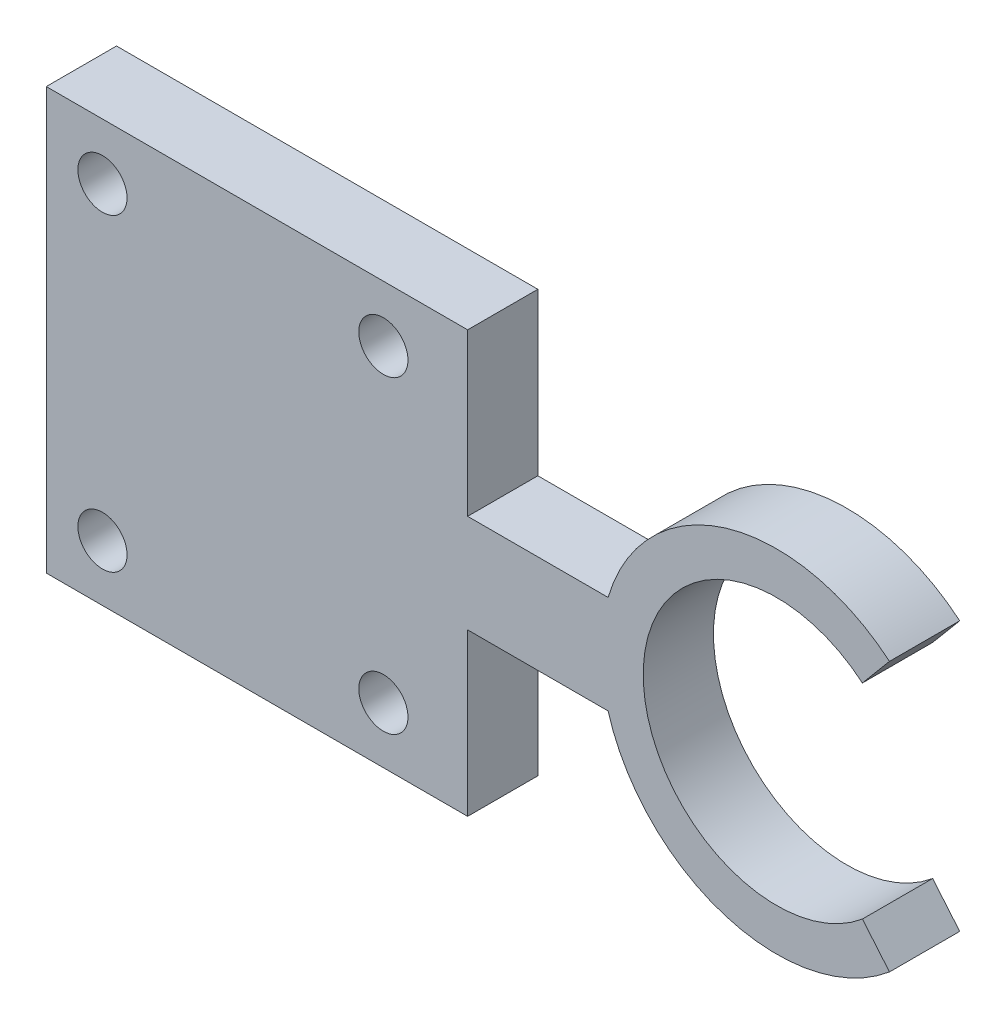
ISO-10303-21;
HEADER;
FILE_DESCRIPTION(('STEP AP214'),'2;1');
FILE_NAME('part.step','',(''),(''),'','','');
FILE_SCHEMA(('AUTOMOTIVE_DESIGN { 1 0 10303 214 1 1 1 1 }'));
ENDSEC;
DATA;
#1=APPLICATION_CONTEXT('core data for automotive mechanical design processes');
#2=APPLICATION_PROTOCOL_DEFINITION('international standard','automotive_design',2000,#1);
#3=PRODUCT_CONTEXT('',#1,'mechanical');
#4=PRODUCT('Part','Part','',(#3));
#5=PRODUCT_RELATED_PRODUCT_CATEGORY('part','',(#4));
#6=PRODUCT_DEFINITION_FORMATION('','',#4);
#7=PRODUCT_DEFINITION_CONTEXT('part definition',#1,'design');
#8=PRODUCT_DEFINITION('design','',#6,#7);
#9=PRODUCT_DEFINITION_SHAPE('','',#8);
#10=(LENGTH_UNIT() NAMED_UNIT(*) SI_UNIT(.MILLI.,.METRE.));
#11=(NAMED_UNIT(*) PLANE_ANGLE_UNIT() SI_UNIT($,.RADIAN.));
#12=(NAMED_UNIT(*) SI_UNIT($,.STERADIAN.) SOLID_ANGLE_UNIT());
#13=UNCERTAINTY_MEASURE_WITH_UNIT(LENGTH_MEASURE(1.E-05),#10,'distance_accuracy_value','');
#14=(GEOMETRIC_REPRESENTATION_CONTEXT(3) GLOBAL_UNCERTAINTY_ASSIGNED_CONTEXT((#13)) GLOBAL_UNIT_ASSIGNED_CONTEXT((#10,
#11,#12)) REPRESENTATION_CONTEXT('',''));
#15=CARTESIAN_POINT('',(0.,0.,0.));
#16=DIRECTION('',(0.,0.,1.));
#17=DIRECTION('',(1.,0.,0.));
#18=AXIS2_PLACEMENT_3D('',#15,#16,#17);
#19=CARTESIAN_POINT('',(-12.,3.5,-2.5));
#20=DIRECTION('',(0.,0.,1.));
#21=DIRECTION('',(1.,0.,0.));
#22=AXIS2_PLACEMENT_3D('',#19,#20,#21);
#23=PLANE('',#22);
#24=DIRECTION('',(-1.,0.,0.));
#25=VECTOR('',#24,1.);
#26=CARTESIAN_POINT('',(-12.,-3.5,-2.5));
#27=LINE('',#26,#25);
#28=CARTESIAN_POINT('',(-12.,-3.5,-2.5));
#29=VERTEX_POINT('',#28);
#30=CARTESIAN_POINT('',(-22.,-3.5,-2.5));
#31=VERTEX_POINT('',#30);
#32=EDGE_CURVE('E212',#29,#31,#27,.T.);
#33=ORIENTED_EDGE('',*,*,#32,.T.);
#34=DIRECTION('',(0.,-1.,0.));
#35=VECTOR('',#34,1.);
#36=CARTESIAN_POINT('',(-22.,15.,-2.5));
#37=LINE('',#36,#35);
#38=CARTESIAN_POINT('',(-22.,-15.,-2.5));
#39=VERTEX_POINT('',#38);
#40=EDGE_CURVE('E156',#31,#39,#37,.T.);
#41=ORIENTED_EDGE('',*,*,#40,.T.);
#42=DIRECTION('',(-1.,0.,0.));
#43=VECTOR('',#42,1.);
#44=CARTESIAN_POINT('',(-22.,-15.,-2.5));
#45=LINE('',#44,#43);
#46=CARTESIAN_POINT('',(-52.,-15.,-2.5));
#47=VERTEX_POINT('',#46);
#48=EDGE_CURVE('E253',#39,#47,#45,.T.);
#49=ORIENTED_EDGE('',*,*,#48,.T.);
#50=DIRECTION('',(0.,-1.,0.));
#51=VECTOR('',#50,1.);
#52=CARTESIAN_POINT('',(-52.,3.5,-2.5));
#53=LINE('',#52,#51);
#54=CARTESIAN_POINT('',(-52.,15.,-2.5));
#55=VERTEX_POINT('',#54);
#56=EDGE_CURVE('E40',#55,#47,#53,.T.);
#57=ORIENTED_EDGE('',*,*,#56,.F.);
#58=DIRECTION('',(1.,0.,0.));
#59=VECTOR('',#58,1.);
#60=CARTESIAN_POINT('',(-22.,15.,-2.5));
#61=LINE('',#60,#59);
#62=CARTESIAN_POINT('',(-22.,15.,-2.5));
#63=VERTEX_POINT('',#62);
#64=EDGE_CURVE('E251',#55,#63,#61,.T.);
#65=ORIENTED_EDGE('',*,*,#64,.T.);
#66=CARTESIAN_POINT('',(-22.,3.5,-2.5));
#67=VERTEX_POINT('',#66);
#68=EDGE_CURVE('E247',#63,#67,#37,.T.);
#69=ORIENTED_EDGE('',*,*,#68,.T.);
#70=DIRECTION('',(-1.,0.,0.));
#71=VECTOR('',#70,1.);
#72=CARTESIAN_POINT('',(-12.,3.5,-2.5));
#73=LINE('',#72,#71);
#74=CARTESIAN_POINT('',(-12.,3.5,-2.5));
#75=VERTEX_POINT('',#74);
#76=EDGE_CURVE('E52',#75,#67,#73,.T.);
#77=ORIENTED_EDGE('',*,*,#76,.F.);
#78=CARTESIAN_POINT('',(0.,0.,-2.5));
#79=DIRECTION('',(0.,0.,1.));
#80=DIRECTION('',(0.642787609686539,0.766044443118978,0.));
#81=AXIS2_PLACEMENT_3D('',#78,#79,#80);
#82=CIRCLE('',#81,12.5);
#83=CARTESIAN_POINT('',(8.03484512108174,9.57555553898723,-2.5));
#84=VERTEX_POINT('',#83);
#85=EDGE_CURVE('E176',#84,#75,#82,.T.);
#86=ORIENTED_EDGE('',*,*,#85,.F.);
#87=DIRECTION('',(0.642787609686539,0.766044443118979,0.));
#88=VECTOR('',#87,1.);
#89=CARTESIAN_POINT('',(6.10648229202213,7.27742220963029,-2.5));
#90=LINE('',#89,#88);
#91=CARTESIAN_POINT('',(6.10648229202213,7.27742220963029,-2.5));
#92=VERTEX_POINT('',#91);
#93=EDGE_CURVE('E194',#92,#84,#90,.T.);
#94=ORIENTED_EDGE('',*,*,#93,.F.);
#95=CARTESIAN_POINT('',(0.,0.,-2.5));
#96=DIRECTION('',(0.,0.,1.));
#97=DIRECTION('',(0.642787609686539,0.766044443118978,0.));
#98=AXIS2_PLACEMENT_3D('',#95,#96,#97);
#99=CIRCLE('',#98,9.5);
#100=CARTESIAN_POINT('',(6.10648229202215,-7.27742220963027,-2.5));
#101=VERTEX_POINT('',#100);
#102=EDGE_CURVE('E196',#92,#101,#99,.T.);
#103=ORIENTED_EDGE('',*,*,#102,.T.);
#104=DIRECTION('',(0.642787609686543,-0.766044443118975,0.));
#105=VECTOR('',#104,1.);
#106=CARTESIAN_POINT('',(6.10648229202215,-7.27742220963027,-2.5));
#107=LINE('',#106,#105);
#108=CARTESIAN_POINT('',(8.03484512108177,-9.5755555389872,-2.5));
#109=VERTEX_POINT('',#108);
#110=EDGE_CURVE('E199',#101,#109,#107,.T.);
#111=ORIENTED_EDGE('',*,*,#110,.T.);
#112=EDGE_CURVE('E183',#29,#109,#82,.T.);
#113=ORIENTED_EDGE('',*,*,#112,.F.);
#114=EDGE_LOOP('',(#33,#41,#49,#57,#65,#69,#77,#86,#94,#103,#111,#113));
#115=FACE_BOUND('',#114,.T.);
#116=CARTESIAN_POINT('',(-47.9999999999998,-11.,-2.5));
#117=DIRECTION('',(0.,0.,1.));
#118=DIRECTION('',(1.,0.,0.));
#119=AXIS2_PLACEMENT_3D('',#116,#117,#118);
#120=CIRCLE('',#119,1.75);
#121=CARTESIAN_POINT('',(-46.2499999999998,-11.,-2.5));
#122=VERTEX_POINT('',#121);
#123=EDGE_CURVE('E161',#122,#122,#120,.F.);
#124=ORIENTED_EDGE('',*,*,#123,.F.);
#125=EDGE_LOOP('',(#124));
#126=FACE_BOUND('',#125,.T.);
#127=CARTESIAN_POINT('',(-27.9999999999998,-11.,-2.5));
#128=DIRECTION('',(0.,0.,1.));
#129=DIRECTION('',(1.,0.,0.));
#130=AXIS2_PLACEMENT_3D('',#127,#128,#129);
#131=CIRCLE('',#130,1.75);
#132=CARTESIAN_POINT('',(-26.2499999999998,-11.,-2.5));
#133=VERTEX_POINT('',#132);
#134=EDGE_CURVE('E164',#133,#133,#131,.F.);
#135=ORIENTED_EDGE('',*,*,#134,.F.);
#136=EDGE_LOOP('',(#135));
#137=FACE_BOUND('',#136,.T.);
#138=CARTESIAN_POINT('',(-48.,11.,-2.5));
#139=DIRECTION('',(0.,0.,1.));
#140=DIRECTION('',(1.,0.,0.));
#141=AXIS2_PLACEMENT_3D('',#138,#139,#140);
#142=CIRCLE('',#141,1.75);
#143=CARTESIAN_POINT('',(-46.25,11.,-2.5));
#144=VERTEX_POINT('',#143);
#145=EDGE_CURVE('E168',#144,#144,#142,.F.);
#146=ORIENTED_EDGE('',*,*,#145,.F.);
#147=EDGE_LOOP('',(#146));
#148=FACE_BOUND('',#147,.T.);
#149=CARTESIAN_POINT('',(-28.,11.,-2.5));
#150=DIRECTION('',(0.,0.,1.));
#151=DIRECTION('',(1.,0.,0.));
#152=AXIS2_PLACEMENT_3D('',#149,#150,#151);
#153=CIRCLE('',#152,1.75);
#154=CARTESIAN_POINT('',(-26.25,11.,-2.5));
#155=VERTEX_POINT('',#154);
#156=EDGE_CURVE('E165',#155,#155,#153,.F.);
#157=ORIENTED_EDGE('',*,*,#156,.F.);
#158=EDGE_LOOP('',(#157));
#159=FACE_BOUND('',#158,.T.);
#160=ADVANCED_FACE('F33',(#115,#126,#137,#148,#159),#23,.F.);
#161=CARTESIAN_POINT('',(-52.,3.5,2.49999999999999));
#162=DIRECTION('',(1.,0.,0.));
#163=DIRECTION('',(0.,0.,-1.));
#164=AXIS2_PLACEMENT_3D('',#161,#162,#163);
#165=PLANE('',#164);
#166=ORIENTED_EDGE('',*,*,#56,.T.);
#167=DIRECTION('',(0.,0.,1.));
#168=VECTOR('',#167,1.);
#169=CARTESIAN_POINT('',(-52.,-15.,-44.9264068711928));
#170=LINE('',#169,#168);
#171=CARTESIAN_POINT('',(-52.,-15.,2.5));
#172=VERTEX_POINT('',#171);
#173=EDGE_CURVE('E133',#47,#172,#170,.T.);
#174=ORIENTED_EDGE('',*,*,#173,.T.);
#175=DIRECTION('',(0.,-1.,0.));
#176=VECTOR('',#175,1.);
#177=CARTESIAN_POINT('',(-52.,3.5,2.49999999999999));
#178=LINE('',#177,#176);
#179=CARTESIAN_POINT('',(-52.,15.,2.5));
#180=VERTEX_POINT('',#179);
#181=EDGE_CURVE('E118',#180,#172,#178,.T.);
#182=ORIENTED_EDGE('',*,*,#181,.F.);
#183=DIRECTION('',(0.,0.,1.));
#184=VECTOR('',#183,1.);
#185=CARTESIAN_POINT('',(-52.,15.,-44.9264068711928));
#186=LINE('',#185,#184);
#187=EDGE_CURVE('E154',#55,#180,#186,.T.);
#188=ORIENTED_EDGE('',*,*,#187,.F.);
#189=EDGE_LOOP('',(#166,#174,#182,#188));
#190=FACE_BOUND('',#189,.T.);
#191=ADVANCED_FACE('F134',(#190),#165,.F.);
#192=CARTESIAN_POINT('',(-12.,3.5,2.5));
#193=DIRECTION('',(0.,0.,-1.));
#194=DIRECTION('',(-1.,0.,0.));
#195=AXIS2_PLACEMENT_3D('',#192,#193,#194);
#196=PLANE('',#195);
#197=DIRECTION('',(1.,0.,0.));
#198=VECTOR('',#197,1.);
#199=CARTESIAN_POINT('',(-12.,3.5,2.5));
#200=LINE('',#199,#198);
#201=CARTESIAN_POINT('',(-22.,3.5,2.5));
#202=VERTEX_POINT('',#201);
#203=CARTESIAN_POINT('',(-12.,3.5,2.5));
#204=VERTEX_POINT('',#203);
#205=EDGE_CURVE('E130',#202,#204,#200,.T.);
#206=ORIENTED_EDGE('',*,*,#205,.F.);
#207=DIRECTION('',(0.,1.,0.));
#208=VECTOR('',#207,1.);
#209=CARTESIAN_POINT('',(-22.,15.,2.5));
#210=LINE('',#209,#208);
#211=CARTESIAN_POINT('',(-22.,15.,2.5));
#212=VERTEX_POINT('',#211);
#213=EDGE_CURVE('E143',#202,#212,#210,.T.);
#214=ORIENTED_EDGE('',*,*,#213,.T.);
#215=DIRECTION('',(-1.,0.,0.));
#216=VECTOR('',#215,1.);
#217=CARTESIAN_POINT('',(-22.,15.,2.5));
#218=LINE('',#217,#216);
#219=EDGE_CURVE('E126',#212,#180,#218,.T.);
#220=ORIENTED_EDGE('',*,*,#219,.T.);
#221=ORIENTED_EDGE('',*,*,#181,.T.);
#222=DIRECTION('',(1.,0.,0.));
#223=VECTOR('',#222,1.);
#224=CARTESIAN_POINT('',(-22.,-15.,2.5));
#225=LINE('',#224,#223);
#226=CARTESIAN_POINT('',(-22.,-15.,2.5));
#227=VERTEX_POINT('',#226);
#228=EDGE_CURVE('E124',#172,#227,#225,.T.);
#229=ORIENTED_EDGE('',*,*,#228,.T.);
#230=CARTESIAN_POINT('',(-22.,-3.5,2.5));
#231=VERTEX_POINT('',#230);
#232=EDGE_CURVE('E146',#227,#231,#210,.T.);
#233=ORIENTED_EDGE('',*,*,#232,.T.);
#234=DIRECTION('',(1.,0.,0.));
#235=VECTOR('',#234,1.);
#236=CARTESIAN_POINT('',(-12.,-3.5,2.5));
#237=LINE('',#236,#235);
#238=CARTESIAN_POINT('',(-12.,-3.5,2.5));
#239=VERTEX_POINT('',#238);
#240=EDGE_CURVE('E207',#231,#239,#237,.T.);
#241=ORIENTED_EDGE('',*,*,#240,.T.);
#242=CARTESIAN_POINT('',(0.,0.,2.5));
#243=DIRECTION('',(0.,0.,1.));
#244=DIRECTION('',(0.642787609686541,0.766044443118977,0.));
#245=AXIS2_PLACEMENT_3D('',#242,#243,#244);
#246=CIRCLE('',#245,12.5);
#247=CARTESIAN_POINT('',(8.03484512108176,-9.57555553898721,2.5));
#248=VERTEX_POINT('',#247);
#249=EDGE_CURVE('E175',#239,#248,#246,.T.);
#250=ORIENTED_EDGE('',*,*,#249,.T.);
#251=DIRECTION('',(-0.642787609686541,0.766044443118977,0.));
#252=VECTOR('',#251,1.);
#253=CARTESIAN_POINT('',(8.03484512108176,-9.57555553898721,2.5));
#254=LINE('',#253,#252);
#255=CARTESIAN_POINT('',(6.10648229202213,-7.27742220963028,2.5));
#256=VERTEX_POINT('',#255);
#257=EDGE_CURVE('E180',#248,#256,#254,.T.);
#258=ORIENTED_EDGE('',*,*,#257,.T.);
#259=CARTESIAN_POINT('',(0.,0.,2.5));
#260=DIRECTION('',(0.,0.,1.));
#261=DIRECTION('',(0.642787609686541,0.766044443118977,0.));
#262=AXIS2_PLACEMENT_3D('',#259,#260,#261);
#263=CIRCLE('',#262,9.5);
#264=CARTESIAN_POINT('',(6.10648229202214,7.27742220963028,2.5));
#265=VERTEX_POINT('',#264);
#266=EDGE_CURVE('E188',#265,#256,#263,.T.);
#267=ORIENTED_EDGE('',*,*,#266,.F.);
#268=DIRECTION('',(-0.642787609686541,-0.766044443118977,0.));
#269=VECTOR('',#268,1.);
#270=CARTESIAN_POINT('',(8.03484512108176,9.57555553898721,2.5));
#271=LINE('',#270,#269);
#272=CARTESIAN_POINT('',(8.03484512108176,9.57555553898721,2.5));
#273=VERTEX_POINT('',#272);
#274=EDGE_CURVE('E171',#273,#265,#271,.T.);
#275=ORIENTED_EDGE('',*,*,#274,.F.);
#276=EDGE_CURVE('E177',#273,#204,#246,.T.);
#277=ORIENTED_EDGE('',*,*,#276,.T.);
#278=EDGE_LOOP('',(#206,#214,#220,#221,#229,#233,#241,#250,#258,#267,#275,#277));
#279=FACE_BOUND('',#278,.T.);
#280=CARTESIAN_POINT('',(-47.9999999999998,-11.,2.5));
#281=DIRECTION('',(0.,0.,1.));
#282=DIRECTION('',(1.,0.,0.));
#283=AXIS2_PLACEMENT_3D('',#280,#281,#282);
#284=CIRCLE('',#283,1.75);
#285=CARTESIAN_POINT('',(-46.2499999999998,-11.,2.5));
#286=VERTEX_POINT('',#285);
#287=EDGE_CURVE('E258',#286,#286,#284,.T.);
#288=ORIENTED_EDGE('',*,*,#287,.F.);
#289=EDGE_LOOP('',(#288));
#290=FACE_BOUND('',#289,.T.);
#291=CARTESIAN_POINT('',(-27.9999999999998,-11.,2.5));
#292=DIRECTION('',(0.,0.,1.));
#293=DIRECTION('',(1.,0.,0.));
#294=AXIS2_PLACEMENT_3D('',#291,#292,#293);
#295=CIRCLE('',#294,1.75);
#296=CARTESIAN_POINT('',(-26.2499999999998,-11.,2.5));
#297=VERTEX_POINT('',#296);
#298=EDGE_CURVE('E261',#297,#297,#295,.T.);
#299=ORIENTED_EDGE('',*,*,#298,.F.);
#300=EDGE_LOOP('',(#299));
#301=FACE_BOUND('',#300,.T.);
#302=CARTESIAN_POINT('',(-48.,11.,2.5));
#303=DIRECTION('',(0.,0.,1.));
#304=DIRECTION('',(1.,0.,0.));
#305=AXIS2_PLACEMENT_3D('',#302,#303,#304);
#306=CIRCLE('',#305,1.75);
#307=CARTESIAN_POINT('',(-46.25,11.,2.5));
#308=VERTEX_POINT('',#307);
#309=EDGE_CURVE('E144',#308,#308,#306,.T.);
#310=ORIENTED_EDGE('',*,*,#309,.F.);
#311=EDGE_LOOP('',(#310));
#312=FACE_BOUND('',#311,.T.);
#313=CARTESIAN_POINT('',(-28.,11.,2.5));
#314=DIRECTION('',(0.,0.,1.));
#315=DIRECTION('',(1.,0.,0.));
#316=AXIS2_PLACEMENT_3D('',#313,#314,#315);
#317=CIRCLE('',#316,1.75);
#318=CARTESIAN_POINT('',(-26.25,11.,2.5));
#319=VERTEX_POINT('',#318);
#320=EDGE_CURVE('E149',#319,#319,#317,.T.);
#321=ORIENTED_EDGE('',*,*,#320,.F.);
#322=EDGE_LOOP('',(#321));
#323=FACE_BOUND('',#322,.T.);
#324=ADVANCED_FACE('F120',(#279,#290,#301,#312,#323),#196,.F.);
#325=CARTESIAN_POINT('',(0.,3.5,0.));
#326=DIRECTION('',(0.,-1.,0.));
#327=DIRECTION('',(0.,0.,-1.));
#328=AXIS2_PLACEMENT_3D('',#325,#326,#327);
#329=PLANE('',#328);
#330=ORIENTED_EDGE('',*,*,#76,.T.);
#331=DIRECTION('',(0.,0.,1.));
#332=VECTOR('',#331,1.);
#333=CARTESIAN_POINT('',(-22.,3.5,0.));
#334=LINE('',#333,#332);
#335=EDGE_CURVE('E47',#67,#202,#334,.T.);
#336=ORIENTED_EDGE('',*,*,#335,.T.);
#337=ORIENTED_EDGE('',*,*,#205,.T.);
#338=DIRECTION('',(0.,0.,-1.));
#339=VECTOR('',#338,1.);
#340=CARTESIAN_POINT('',(-12.,3.5,-2.5));
#341=LINE('',#340,#339);
#342=EDGE_CURVE('E205',#204,#75,#341,.T.);
#343=ORIENTED_EDGE('',*,*,#342,.T.);
#344=EDGE_LOOP('',(#330,#336,#337,#343));
#345=FACE_BOUND('',#344,.T.);
#346=ADVANCED_FACE('F269',(#345),#329,.F.);
#347=CARTESIAN_POINT('',(0.,-3.5,0.));
#348=DIRECTION('',(0.,-1.,0.));
#349=DIRECTION('',(0.,0.,-1.));
#350=AXIS2_PLACEMENT_3D('',#347,#348,#349);
#351=PLANE('',#350);
#352=DIRECTION('',(0.,0.,1.));
#353=VECTOR('',#352,1.);
#354=CARTESIAN_POINT('',(-22.,-3.5,0.));
#355=LINE('',#354,#353);
#356=EDGE_CURVE('E11',#31,#231,#355,.T.);
#357=ORIENTED_EDGE('',*,*,#356,.F.);
#358=ORIENTED_EDGE('',*,*,#32,.F.);
#359=DIRECTION('',(0.,0.,-1.));
#360=VECTOR('',#359,1.);
#361=CARTESIAN_POINT('',(-12.,-3.5,-2.5));
#362=LINE('',#361,#360);
#363=EDGE_CURVE('E204',#239,#29,#362,.T.);
#364=ORIENTED_EDGE('',*,*,#363,.F.);
#365=ORIENTED_EDGE('',*,*,#240,.F.);
#366=EDGE_LOOP('',(#357,#358,#364,#365));
#367=FACE_BOUND('',#366,.T.);
#368=ADVANCED_FACE('F220',(#367),#351,.T.);
#369=CARTESIAN_POINT('',(0.,0.,0.));
#370=DIRECTION('',(0.,0.,1.));
#371=DIRECTION('',(1.,0.,0.));
#372=AXIS2_PLACEMENT_3D('',#369,#370,#371);
#373=CYLINDRICAL_SURFACE('',#372,12.5);
#374=ORIENTED_EDGE('',*,*,#85,.T.);
#375=ORIENTED_EDGE('',*,*,#342,.F.);
#376=ORIENTED_EDGE('',*,*,#276,.F.);
#377=DIRECTION('',(0.,0.,1.));
#378=VECTOR('',#377,1.);
#379=CARTESIAN_POINT('',(8.03484512108174,9.57555553898723,-2.5));
#380=LINE('',#379,#378);
#381=EDGE_CURVE('E167',#84,#273,#380,.T.);
#382=ORIENTED_EDGE('',*,*,#381,.F.);
#383=EDGE_LOOP('',(#374,#375,#376,#382));
#384=FACE_BOUND('',#383,.T.);
#385=ADVANCED_FACE('F240',(#384),#373,.T.);
#386=CARTESIAN_POINT('',(0.,0.,0.));
#387=DIRECTION('',(0.766044443118977,-0.64278760968654,0.));
#388=DIRECTION('',(0.642787609686541,0.766044443118977,0.));
#389=AXIS2_PLACEMENT_3D('',#386,#387,#388);
#390=PLANE('',#389);
#391=ORIENTED_EDGE('',*,*,#381,.T.);
#392=ORIENTED_EDGE('',*,*,#274,.T.);
#393=DIRECTION('',(0.,0.,-1.));
#394=VECTOR('',#393,1.);
#395=CARTESIAN_POINT('',(6.10648229202214,7.27742220963028,2.5));
#396=LINE('',#395,#394);
#397=EDGE_CURVE('E186',#265,#92,#396,.T.);
#398=ORIENTED_EDGE('',*,*,#397,.T.);
#399=ORIENTED_EDGE('',*,*,#93,.T.);
#400=EDGE_LOOP('',(#391,#392,#398,#399));
#401=FACE_BOUND('',#400,.T.);
#402=ADVANCED_FACE('F235',(#401),#390,.T.);
#403=CARTESIAN_POINT('',(0.,0.,0.));
#404=DIRECTION('',(-0.766044443118977,-0.642787609686541,0.));
#405=DIRECTION('',(0.642787609686541,-0.766044443118977,0.));
#406=AXIS2_PLACEMENT_3D('',#403,#404,#405);
#407=PLANE('',#406);
#408=DIRECTION('',(0.,0.,1.));
#409=VECTOR('',#408,1.);
#410=CARTESIAN_POINT('',(8.03484512108177,-9.5755555389872,-2.5));
#411=LINE('',#410,#409);
#412=EDGE_CURVE('E172',#109,#248,#411,.T.);
#413=ORIENTED_EDGE('',*,*,#412,.F.);
#414=ORIENTED_EDGE('',*,*,#110,.F.);
#415=DIRECTION('',(0.,0.,-1.));
#416=VECTOR('',#415,1.);
#417=CARTESIAN_POINT('',(6.10648229202213,-7.27742220963028,2.5));
#418=LINE('',#417,#416);
#419=EDGE_CURVE('E191',#256,#101,#418,.T.);
#420=ORIENTED_EDGE('',*,*,#419,.F.);
#421=ORIENTED_EDGE('',*,*,#257,.F.);
#422=EDGE_LOOP('',(#413,#414,#420,#421));
#423=FACE_BOUND('',#422,.T.);
#424=ADVANCED_FACE('F229',(#423),#407,.F.);
#425=ORIENTED_EDGE('',*,*,#363,.T.);
#426=ORIENTED_EDGE('',*,*,#112,.T.);
#427=ORIENTED_EDGE('',*,*,#412,.T.);
#428=ORIENTED_EDGE('',*,*,#249,.F.);
#429=EDGE_LOOP('',(#425,#426,#427,#428));
#430=FACE_BOUND('',#429,.T.);
#431=ADVANCED_FACE('F223',(#430),#373,.T.);
#432=CARTESIAN_POINT('',(0.,0.,0.));
#433=DIRECTION('',(0.,0.,1.));
#434=DIRECTION('',(1.,0.,0.));
#435=AXIS2_PLACEMENT_3D('',#432,#433,#434);
#436=CYLINDRICAL_SURFACE('',#435,9.5);
#437=ORIENTED_EDGE('',*,*,#102,.F.);
#438=ORIENTED_EDGE('',*,*,#397,.F.);
#439=ORIENTED_EDGE('',*,*,#266,.T.);
#440=ORIENTED_EDGE('',*,*,#419,.T.);
#441=EDGE_LOOP('',(#437,#438,#439,#440));
#442=FACE_BOUND('',#441,.T.);
#443=ADVANCED_FACE('F233',(#442),#436,.F.);
#444=CARTESIAN_POINT('',(-27.9999999999998,-11.,-44.9264068711928));
#445=DIRECTION('',(0.,0.,1.));
#446=DIRECTION('',(1.,0.,0.));
#447=AXIS2_PLACEMENT_3D('',#444,#445,#446);
#448=CYLINDRICAL_SURFACE('',#447,1.75);
#449=ORIENTED_EDGE('',*,*,#134,.T.);
#450=EDGE_LOOP('',(#449));
#451=FACE_BOUND('',#450,.T.);
#452=ORIENTED_EDGE('',*,*,#298,.T.);
#453=EDGE_LOOP('',(#452));
#454=FACE_BOUND('',#453,.T.);
#455=ADVANCED_FACE('F297',(#451,#454),#448,.F.);
#456=CARTESIAN_POINT('',(-47.9999999999998,-11.,-44.9264068711928));
#457=DIRECTION('',(0.,0.,1.));
#458=DIRECTION('',(1.,0.,0.));
#459=AXIS2_PLACEMENT_3D('',#456,#457,#458);
#460=CYLINDRICAL_SURFACE('',#459,1.75);
#461=ORIENTED_EDGE('',*,*,#123,.T.);
#462=EDGE_LOOP('',(#461));
#463=FACE_BOUND('',#462,.T.);
#464=ORIENTED_EDGE('',*,*,#287,.T.);
#465=EDGE_LOOP('',(#464));
#466=FACE_BOUND('',#465,.T.);
#467=ADVANCED_FACE('F300',(#463,#466),#460,.F.);
#468=CARTESIAN_POINT('',(-22.,-15.,-44.9264068711928));
#469=DIRECTION('',(0.,-1.,0.));
#470=DIRECTION('',(1.,0.,0.));
#471=AXIS2_PLACEMENT_3D('',#468,#469,#470);
#472=PLANE('',#471);
#473=ORIENTED_EDGE('',*,*,#48,.F.);
#474=DIRECTION('',(0.,0.,1.));
#475=VECTOR('',#474,1.);
#476=CARTESIAN_POINT('',(-22.,-15.,-44.9264068711928));
#477=LINE('',#476,#475);
#478=EDGE_CURVE('E138',#39,#227,#477,.T.);
#479=ORIENTED_EDGE('',*,*,#478,.T.);
#480=ORIENTED_EDGE('',*,*,#228,.F.);
#481=ORIENTED_EDGE('',*,*,#173,.F.);
#482=EDGE_LOOP('',(#473,#479,#480,#481));
#483=FACE_BOUND('',#482,.T.);
#484=ADVANCED_FACE('F140',(#483),#472,.T.);
#485=CARTESIAN_POINT('',(-22.,15.,-44.9264068711928));
#486=DIRECTION('',(1.,0.,0.));
#487=DIRECTION('',(0.,1.,0.));
#488=AXIS2_PLACEMENT_3D('',#485,#486,#487);
#489=PLANE('',#488);
#490=ORIENTED_EDGE('',*,*,#40,.F.);
#491=ORIENTED_EDGE('',*,*,#356,.T.);
#492=ORIENTED_EDGE('',*,*,#232,.F.);
#493=ORIENTED_EDGE('',*,*,#478,.F.);
#494=EDGE_LOOP('',(#490,#491,#492,#493));
#495=FACE_BOUND('',#494,.T.);
#496=ADVANCED_FACE('F317',(#495),#489,.T.);
#497=ORIENTED_EDGE('',*,*,#335,.F.);
#498=ORIENTED_EDGE('',*,*,#68,.F.);
#499=DIRECTION('',(0.,0.,1.));
#500=VECTOR('',#499,1.);
#501=CARTESIAN_POINT('',(-22.,15.,-44.9264068711928));
#502=LINE('',#501,#500);
#503=EDGE_CURVE('E157',#63,#212,#502,.T.);
#504=ORIENTED_EDGE('',*,*,#503,.T.);
#505=ORIENTED_EDGE('',*,*,#213,.F.);
#506=EDGE_LOOP('',(#497,#498,#504,#505));
#507=FACE_BOUND('',#506,.T.);
#508=ADVANCED_FACE('F243',(#507),#489,.T.);
#509=CARTESIAN_POINT('',(-22.,15.,-44.9264068711928));
#510=DIRECTION('',(0.,1.,0.));
#511=DIRECTION('',(-1.,0.,0.));
#512=AXIS2_PLACEMENT_3D('',#509,#510,#511);
#513=PLANE('',#512);
#514=ORIENTED_EDGE('',*,*,#64,.F.);
#515=ORIENTED_EDGE('',*,*,#187,.T.);
#516=ORIENTED_EDGE('',*,*,#219,.F.);
#517=ORIENTED_EDGE('',*,*,#503,.F.);
#518=EDGE_LOOP('',(#514,#515,#516,#517));
#519=FACE_BOUND('',#518,.T.);
#520=ADVANCED_FACE('F250',(#519),#513,.T.);
#521=CARTESIAN_POINT('',(-48.,11.,-44.9264068711928));
#522=DIRECTION('',(0.,0.,1.));
#523=DIRECTION('',(1.,0.,0.));
#524=AXIS2_PLACEMENT_3D('',#521,#522,#523);
#525=CYLINDRICAL_SURFACE('',#524,1.75);
#526=ORIENTED_EDGE('',*,*,#145,.T.);
#527=EDGE_LOOP('',(#526));
#528=FACE_BOUND('',#527,.T.);
#529=ORIENTED_EDGE('',*,*,#309,.T.);
#530=EDGE_LOOP('',(#529));
#531=FACE_BOUND('',#530,.T.);
#532=ADVANCED_FACE('F307',(#528,#531),#525,.F.);
#533=CARTESIAN_POINT('',(-28.,11.,-44.9264068711928));
#534=DIRECTION('',(0.,0.,1.));
#535=DIRECTION('',(1.,0.,0.));
#536=AXIS2_PLACEMENT_3D('',#533,#534,#535);
#537=CYLINDRICAL_SURFACE('',#536,1.75);
#538=ORIENTED_EDGE('',*,*,#156,.T.);
#539=EDGE_LOOP('',(#538));
#540=FACE_BOUND('',#539,.T.);
#541=ORIENTED_EDGE('',*,*,#320,.T.);
#542=EDGE_LOOP('',(#541));
#543=FACE_BOUND('',#542,.T.);
#544=ADVANCED_FACE('F266',(#540,#543),#537,.F.);
#545=CLOSED_SHELL('',(#160,#191,#324,#346,#368,#385,#402,#424,#431,#443,#455,#467,#484,#496,
#508,#520,#532,#544));
#546=MANIFOLD_SOLID_BREP('B2',#545);
#547=ADVANCED_BREP_SHAPE_REPRESENTATION('',(#18,#546),#14);
#548=SHAPE_DEFINITION_REPRESENTATION(#9,#547);
ENDSEC;
END-ISO-10303-21;
